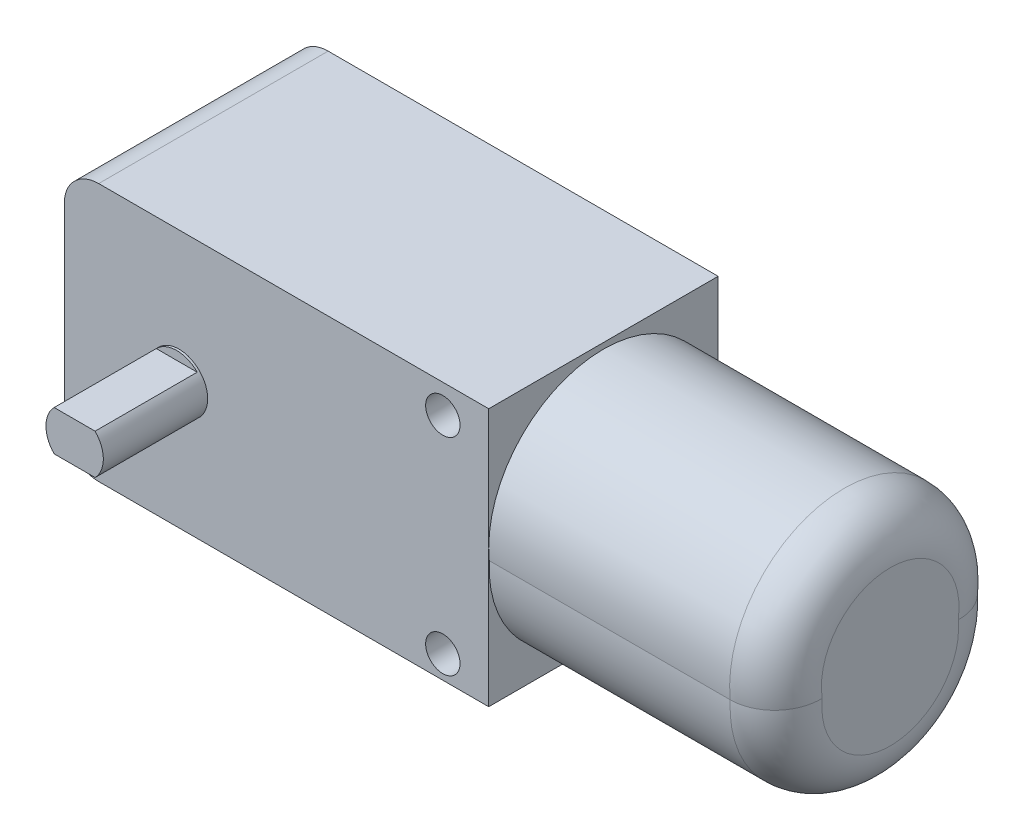
ISO-10303-21;
HEADER;
FILE_DESCRIPTION(('STEP AP214'),'2;1');
FILE_NAME('part.step','',(''),(''),'','','');
FILE_SCHEMA(('AUTOMOTIVE_DESIGN { 1 0 10303 214 1 1 1 1 }'));
ENDSEC;
DATA;
#1=APPLICATION_CONTEXT('core data for automotive mechanical design processes');
#2=APPLICATION_PROTOCOL_DEFINITION('international standard','automotive_design',2000,#1);
#3=PRODUCT_CONTEXT('',#1,'mechanical');
#4=PRODUCT('Part','Part','',(#3));
#5=PRODUCT_RELATED_PRODUCT_CATEGORY('part','',(#4));
#6=PRODUCT_DEFINITION_FORMATION('','',#4);
#7=PRODUCT_DEFINITION_CONTEXT('part definition',#1,'design');
#8=PRODUCT_DEFINITION('design','',#6,#7);
#9=PRODUCT_DEFINITION_SHAPE('','',#8);
#10=(LENGTH_UNIT() NAMED_UNIT(*) SI_UNIT(.MILLI.,.METRE.));
#11=(NAMED_UNIT(*) PLANE_ANGLE_UNIT() SI_UNIT($,.RADIAN.));
#12=(NAMED_UNIT(*) SI_UNIT($,.STERADIAN.) SOLID_ANGLE_UNIT());
#13=UNCERTAINTY_MEASURE_WITH_UNIT(LENGTH_MEASURE(1.E-05),#10,'distance_accuracy_value','');
#14=(GEOMETRIC_REPRESENTATION_CONTEXT(3) GLOBAL_UNCERTAINTY_ASSIGNED_CONTEXT((#13)) GLOBAL_UNIT_ASSIGNED_CONTEXT((#10,
#11,#12)) REPRESENTATION_CONTEXT('',''));
#15=CARTESIAN_POINT('',(0.,0.,0.));
#16=DIRECTION('',(0.,0.,1.));
#17=DIRECTION('',(1.,0.,0.));
#18=AXIS2_PLACEMENT_3D('',#15,#16,#17);
#19=CARTESIAN_POINT('',(-64.2641007815364,-2.5,-20.));
#20=DIRECTION('',(-1.,0.,0.));
#21=DIRECTION('',(0.,0.,1.));
#22=AXIS2_PLACEMENT_3D('',#19,#20,#21);
#23=PLANE('',#22);
#24=DIRECTION('',(0.,-1.,0.));
#25=VECTOR('',#24,1.);
#26=CARTESIAN_POINT('',(-64.2641007815364,-2.5,0.));
#27=LINE('',#26,#25);
#28=CARTESIAN_POINT('',(-64.2641007815364,-5.5,0.));
#29=VERTEX_POINT('',#28);
#30=CARTESIAN_POINT('',(-64.2641007815364,-22.,0.));
#31=VERTEX_POINT('',#30);
#32=EDGE_CURVE('E236',#29,#31,#27,.T.);
#33=ORIENTED_EDGE('',*,*,#32,.F.);
#34=DIRECTION('',(0.,0.,1.));
#35=VECTOR('',#34,1.);
#36=CARTESIAN_POINT('',(-64.2641007815364,-5.5,-20.));
#37=LINE('',#36,#35);
#38=CARTESIAN_POINT('',(-64.2641007815364,-5.5,-20.));
#39=VERTEX_POINT('',#38);
#40=EDGE_CURVE('E294',#29,#39,#37,.F.);
#41=ORIENTED_EDGE('',*,*,#40,.T.);
#42=DIRECTION('',(0.,-1.,0.));
#43=VECTOR('',#42,1.);
#44=CARTESIAN_POINT('',(-64.2641007815364,-2.5,-20.));
#45=LINE('',#44,#43);
#46=CARTESIAN_POINT('',(-64.2641007815364,-22.,-20.));
#47=VERTEX_POINT('',#46);
#48=EDGE_CURVE('E237',#39,#47,#45,.T.);
#49=ORIENTED_EDGE('',*,*,#48,.T.);
#50=DIRECTION('',(0.,0.,1.));
#51=VECTOR('',#50,1.);
#52=CARTESIAN_POINT('',(-64.2641007815364,-22.,-20.));
#53=LINE('',#52,#51);
#54=EDGE_CURVE('E290',#47,#31,#53,.T.);
#55=ORIENTED_EDGE('',*,*,#54,.T.);
#56=EDGE_LOOP('',(#33,#41,#49,#55));
#57=FACE_BOUND('',#56,.T.);
#58=DIRECTION('',(0.,0.,-1.));
#59=VECTOR('',#58,1.);
#60=CARTESIAN_POINT('',(-64.2641007815364,-11.25,-8.625));
#61=LINE('',#60,#59);
#62=CARTESIAN_POINT('',(-64.2641007815364,-11.25,-8.625));
#63=VERTEX_POINT('',#62);
#64=CARTESIAN_POINT('',(-64.2641007815364,-11.25,-11.375));
#65=VERTEX_POINT('',#64);
#66=EDGE_CURVE('E523',#63,#65,#61,.T.);
#67=ORIENTED_EDGE('',*,*,#66,.F.);
#68=DIRECTION('',(0.,1.,0.));
#69=VECTOR('',#68,1.);
#70=CARTESIAN_POINT('',(-64.2641007815364,-16.25,-8.625));
#71=LINE('',#70,#69);
#72=CARTESIAN_POINT('',(-64.2641007815364,-16.25,-8.625));
#73=VERTEX_POINT('',#72);
#74=EDGE_CURVE('E504',#73,#63,#71,.T.);
#75=ORIENTED_EDGE('',*,*,#74,.F.);
#76=DIRECTION('',(0.,0.,1.));
#77=VECTOR('',#76,1.);
#78=CARTESIAN_POINT('',(-64.2641007815364,-16.25,-8.625));
#79=LINE('',#78,#77);
#80=CARTESIAN_POINT('',(-64.2641007815364,-16.25,-11.375));
#81=VERTEX_POINT('',#80);
#82=EDGE_CURVE('E510',#81,#73,#79,.T.);
#83=ORIENTED_EDGE('',*,*,#82,.F.);
#84=DIRECTION('',(0.,-1.,0.));
#85=VECTOR('',#84,1.);
#86=CARTESIAN_POINT('',(-64.2641007815364,-16.25,-11.375));
#87=LINE('',#86,#85);
#88=EDGE_CURVE('E526',#65,#81,#87,.T.);
#89=ORIENTED_EDGE('',*,*,#88,.F.);
#90=EDGE_LOOP('',(#67,#75,#83,#89));
#91=FACE_BOUND('',#90,.T.);
#92=ADVANCED_FACE('F41',(#57,#91),#23,.T.);
#93=CARTESIAN_POINT('',(-27.2641007815364,-2.5,-20.));
#94=DIRECTION('',(1.,0.,0.));
#95=DIRECTION('',(0.,1.,0.));
#96=AXIS2_PLACEMENT_3D('',#93,#94,#95);
#97=PLANE('',#96);
#98=CARTESIAN_POINT('',(-27.2641007815364,-13.,-10.));
#99=DIRECTION('',(1.,0.,0.));
#100=DIRECTION('',(0.,1.,0.));
#101=AXIS2_PLACEMENT_3D('',#98,#99,#100);
#102=CIRCLE('',#101,10.);
#103=CARTESIAN_POINT('',(-27.2641007815364,-14.,-19.9498743710662));
#104=VERTEX_POINT('',#103);
#105=CARTESIAN_POINT('',(-27.2641007815364,-13.,-20.));
#106=VERTEX_POINT('',#105);
#107=EDGE_CURVE('E210',#104,#106,#102,.T.);
#108=ORIENTED_EDGE('',*,*,#107,.F.);
#109=CARTESIAN_POINT('',(-27.2641007815364,-14.5,-10.));
#110=DIRECTION('',(1.,0.,0.));
#111=DIRECTION('',(0.,1.,0.));
#112=AXIS2_PLACEMENT_3D('',#109,#110,#111);
#113=CIRCLE('',#112,9.96242942258564);
#114=CARTESIAN_POINT('',(-27.2641007815364,-14.,-0.050125628933799));
#115=VERTEX_POINT('',#114);
#116=EDGE_CURVE('E214',#115,#104,#113,.T.);
#117=ORIENTED_EDGE('',*,*,#116,.F.);
#118=CARTESIAN_POINT('',(-27.2641007815364,-13.,0.));
#119=VERTEX_POINT('',#118);
#120=EDGE_CURVE('E217',#119,#115,#102,.T.);
#121=ORIENTED_EDGE('',*,*,#120,.F.);
#122=DIRECTION('',(0.,1.,0.));
#123=VECTOR('',#122,1.);
#124=CARTESIAN_POINT('',(-27.2641007815364,-2.5,0.));
#125=LINE('',#124,#123);
#126=CARTESIAN_POINT('',(-27.2641007815364,-25.,0.));
#127=VERTEX_POINT('',#126);
#128=EDGE_CURVE('E262',#127,#119,#125,.T.);
#129=ORIENTED_EDGE('',*,*,#128,.F.);
#130=DIRECTION('',(0.,0.,1.));
#131=VECTOR('',#130,1.);
#132=CARTESIAN_POINT('',(-27.2641007815364,-25.,-20.));
#133=LINE('',#132,#131);
#134=CARTESIAN_POINT('',(-27.2641007815364,-25.,-20.));
#135=VERTEX_POINT('',#134);
#136=EDGE_CURVE('E254',#135,#127,#133,.T.);
#137=ORIENTED_EDGE('',*,*,#136,.F.);
#138=DIRECTION('',(0.,1.,0.));
#139=VECTOR('',#138,1.);
#140=CARTESIAN_POINT('',(-27.2641007815364,-2.5,-20.));
#141=LINE('',#140,#139);
#142=EDGE_CURVE('E246',#135,#106,#141,.T.);
#143=ORIENTED_EDGE('',*,*,#142,.T.);
#144=EDGE_LOOP('',(#108,#117,#121,#129,#137,#143));
#145=FACE_BOUND('',#144,.T.);
#146=ADVANCED_FACE('F351',(#145),#97,.T.);
#147=CARTESIAN_POINT('',(-64.2641007815364,-2.5,-20.));
#148=DIRECTION('',(0.,1.,0.));
#149=DIRECTION('',(0.,0.,1.));
#150=AXIS2_PLACEMENT_3D('',#147,#148,#149);
#151=PLANE('',#150);
#152=DIRECTION('',(-1.,0.,0.));
#153=VECTOR('',#152,1.);
#154=CARTESIAN_POINT('',(-64.2641007815364,-2.5,-20.));
#155=LINE('',#154,#153);
#156=CARTESIAN_POINT('',(-27.2641007815364,-2.5,-20.));
#157=VERTEX_POINT('',#156);
#158=CARTESIAN_POINT('',(-61.2641007815363,-2.5,-20.));
#159=VERTEX_POINT('',#158);
#160=EDGE_CURVE('E250',#157,#159,#155,.T.);
#161=ORIENTED_EDGE('',*,*,#160,.T.);
#162=DIRECTION('',(0.,0.,1.));
#163=VECTOR('',#162,1.);
#164=CARTESIAN_POINT('',(-61.2641007815363,-2.5,-20.));
#165=LINE('',#164,#163);
#166=CARTESIAN_POINT('',(-61.2641007815363,-2.5,0.));
#167=VERTEX_POINT('',#166);
#168=EDGE_CURVE('E280',#159,#167,#165,.T.);
#169=ORIENTED_EDGE('',*,*,#168,.T.);
#170=DIRECTION('',(-1.,0.,0.));
#171=VECTOR('',#170,1.);
#172=CARTESIAN_POINT('',(-64.2641007815364,-2.5,0.));
#173=LINE('',#172,#171);
#174=CARTESIAN_POINT('',(-27.2641007815364,-2.5,0.));
#175=VERTEX_POINT('',#174);
#176=EDGE_CURVE('E242',#175,#167,#173,.T.);
#177=ORIENTED_EDGE('',*,*,#176,.F.);
#178=DIRECTION('',(0.,0.,1.));
#179=VECTOR('',#178,1.);
#180=CARTESIAN_POINT('',(-27.2641007815364,-2.5,-20.));
#181=LINE('',#180,#179);
#182=EDGE_CURVE('E269',#157,#175,#181,.T.);
#183=ORIENTED_EDGE('',*,*,#182,.F.);
#184=EDGE_LOOP('',(#161,#169,#177,#183));
#185=FACE_BOUND('',#184,.T.);
#186=ADVANCED_FACE('F361',(#185),#151,.T.);
#187=EDGE_CURVE('E216',#106,#119,#102,.T.);
#188=ORIENTED_EDGE('',*,*,#187,.F.);
#189=EDGE_CURVE('E245',#106,#157,#141,.T.);
#190=ORIENTED_EDGE('',*,*,#189,.T.);
#191=ORIENTED_EDGE('',*,*,#182,.T.);
#192=EDGE_CURVE('E261',#119,#175,#125,.T.);
#193=ORIENTED_EDGE('',*,*,#192,.F.);
#194=EDGE_LOOP('',(#188,#190,#191,#193));
#195=FACE_BOUND('',#194,.T.);
#196=ADVANCED_FACE('F357',(#195),#97,.T.);
#197=CARTESIAN_POINT('',(-64.2641007815364,-25.,-20.));
#198=DIRECTION('',(0.,-1.,0.));
#199=DIRECTION('',(0.,0.,-1.));
#200=AXIS2_PLACEMENT_3D('',#197,#198,#199);
#201=PLANE('',#200);
#202=DIRECTION('',(1.,0.,0.));
#203=VECTOR('',#202,1.);
#204=CARTESIAN_POINT('',(-64.2641007815364,-25.,0.));
#205=LINE('',#204,#203);
#206=CARTESIAN_POINT('',(-61.2641007815363,-25.,0.));
#207=VERTEX_POINT('',#206);
#208=EDGE_CURVE('E258',#207,#127,#205,.T.);
#209=ORIENTED_EDGE('',*,*,#208,.F.);
#210=DIRECTION('',(0.,0.,1.));
#211=VECTOR('',#210,1.);
#212=CARTESIAN_POINT('',(-61.2641007815363,-25.,-20.));
#213=LINE('',#212,#211);
#214=CARTESIAN_POINT('',(-61.2641007815363,-25.,-20.));
#215=VERTEX_POINT('',#214);
#216=EDGE_CURVE('E302',#207,#215,#213,.F.);
#217=ORIENTED_EDGE('',*,*,#216,.T.);
#218=DIRECTION('',(1.,0.,0.));
#219=VECTOR('',#218,1.);
#220=CARTESIAN_POINT('',(-64.2641007815364,-25.,-20.));
#221=LINE('',#220,#219);
#222=EDGE_CURVE('E241',#215,#135,#221,.T.);
#223=ORIENTED_EDGE('',*,*,#222,.T.);
#224=ORIENTED_EDGE('',*,*,#136,.T.);
#225=EDGE_LOOP('',(#209,#217,#223,#224));
#226=FACE_BOUND('',#225,.T.);
#227=ADVANCED_FACE('F353',(#226),#201,.T.);
#228=CARTESIAN_POINT('',(0.,0.,-20.));
#229=DIRECTION('',(0.,0.,1.));
#230=DIRECTION('',(1.,0.,0.));
#231=AXIS2_PLACEMENT_3D('',#228,#229,#230);
#232=PLANE('',#231);
#233=CARTESIAN_POINT('',(-31.2641007815364,-23.,-20.));
#234=DIRECTION('',(0.,0.,-1.));
#235=DIRECTION('',(-1.,0.,0.));
#236=AXIS2_PLACEMENT_3D('',#233,#234,#235);
#237=CIRCLE('',#236,1.5);
#238=CARTESIAN_POINT('',(-32.7641007815364,-23.,-20.));
#239=VERTEX_POINT('',#238);
#240=EDGE_CURVE('E486',#239,#239,#237,.T.);
#241=ORIENTED_EDGE('',*,*,#240,.F.);
#242=EDGE_LOOP('',(#241));
#243=FACE_BOUND('',#242,.T.);
#244=CARTESIAN_POINT('',(-31.2641007815364,-4.99999999999999,-20.));
#245=DIRECTION('',(0.,0.,-1.));
#246=DIRECTION('',(-1.,0.,0.));
#247=AXIS2_PLACEMENT_3D('',#244,#245,#246);
#248=CIRCLE('',#247,1.5);
#249=CARTESIAN_POINT('',(-32.7641007815364,-4.99999999999999,-20.));
#250=VERTEX_POINT('',#249);
#251=EDGE_CURVE('E491',#250,#250,#248,.T.);
#252=ORIENTED_EDGE('',*,*,#251,.F.);
#253=EDGE_LOOP('',(#252));
#254=FACE_BOUND('',#253,.T.);
#255=CARTESIAN_POINT('',(-54.2641007815363,-14.,-20.));
#256=DIRECTION('',(0.,0.,1.));
#257=DIRECTION('',(1.,0.,0.));
#258=AXIS2_PLACEMENT_3D('',#255,#256,#257);
#259=CIRCLE('',#258,2.5);
#260=CARTESIAN_POINT('',(-51.7641007815363,-14.,-20.));
#261=VERTEX_POINT('',#260);
#262=EDGE_CURVE('E276',#261,#261,#259,.F.);
#263=ORIENTED_EDGE('',*,*,#262,.F.);
#264=EDGE_LOOP('',(#263));
#265=FACE_BOUND('',#264,.T.);
#266=ORIENTED_EDGE('',*,*,#48,.F.);
#267=CARTESIAN_POINT('',(-61.2641007815363,-5.5,-20.));
#268=DIRECTION('',(0.,0.,1.));
#269=DIRECTION('',(1.,0.,0.));
#270=AXIS2_PLACEMENT_3D('',#267,#268,#269);
#271=CIRCLE('',#270,3.);
#272=EDGE_CURVE('E299',#39,#159,#271,.F.);
#273=ORIENTED_EDGE('',*,*,#272,.T.);
#274=ORIENTED_EDGE('',*,*,#160,.F.);
#275=ORIENTED_EDGE('',*,*,#189,.F.);
#276=ORIENTED_EDGE('',*,*,#142,.F.);
#277=ORIENTED_EDGE('',*,*,#222,.F.);
#278=CARTESIAN_POINT('',(-61.2641007815363,-22.,-20.));
#279=DIRECTION('',(0.,0.,1.));
#280=DIRECTION('',(1.,0.,0.));
#281=AXIS2_PLACEMENT_3D('',#278,#279,#280);
#282=CIRCLE('',#281,3.);
#283=EDGE_CURVE('E297',#215,#47,#282,.F.);
#284=ORIENTED_EDGE('',*,*,#283,.T.);
#285=EDGE_LOOP('',(#266,#273,#274,#275,#276,#277,#284));
#286=FACE_BOUND('',#285,.T.);
#287=ADVANCED_FACE('F356',(#243,#254,#265,#286),#232,.F.);
#288=CARTESIAN_POINT('',(0.,0.,0.));
#289=DIRECTION('',(0.,0.,1.));
#290=DIRECTION('',(1.,0.,0.));
#291=AXIS2_PLACEMENT_3D('',#288,#289,#290);
#292=PLANE('',#291);
#293=CARTESIAN_POINT('',(-31.2641007815364,-23.,0.));
#294=DIRECTION('',(0.,0.,1.));
#295=DIRECTION('',(1.,0.,0.));
#296=AXIS2_PLACEMENT_3D('',#293,#294,#295);
#297=CIRCLE('',#296,1.5);
#298=CARTESIAN_POINT('',(-29.7641007815363,-23.,0.));
#299=VERTEX_POINT('',#298);
#300=EDGE_CURVE('E490',#299,#299,#297,.T.);
#301=ORIENTED_EDGE('',*,*,#300,.F.);
#302=EDGE_LOOP('',(#301));
#303=FACE_BOUND('',#302,.T.);
#304=CARTESIAN_POINT('',(-31.2641007815364,-4.99999999999999,0.));
#305=DIRECTION('',(0.,0.,1.));
#306=DIRECTION('',(1.,0.,0.));
#307=AXIS2_PLACEMENT_3D('',#304,#305,#306);
#308=CIRCLE('',#307,1.5);
#309=CARTESIAN_POINT('',(-29.7641007815364,-4.99999999999999,0.));
#310=VERTEX_POINT('',#309);
#311=EDGE_CURVE('E495',#310,#310,#308,.T.);
#312=ORIENTED_EDGE('',*,*,#311,.F.);
#313=EDGE_LOOP('',(#312));
#314=FACE_BOUND('',#313,.T.);
#315=CARTESIAN_POINT('',(-54.2641007815363,-14.,0.));
#316=DIRECTION('',(0.,0.,1.));
#317=DIRECTION('',(1.,0.,0.));
#318=AXIS2_PLACEMENT_3D('',#315,#316,#317);
#319=CIRCLE('',#318,2.5);
#320=CARTESIAN_POINT('',(-51.7641007815363,-14.,0.));
#321=VERTEX_POINT('',#320);
#322=EDGE_CURVE('E218',#321,#321,#319,.T.);
#323=ORIENTED_EDGE('',*,*,#322,.F.);
#324=EDGE_LOOP('',(#323));
#325=FACE_BOUND('',#324,.T.);
#326=ORIENTED_EDGE('',*,*,#176,.T.);
#327=CARTESIAN_POINT('',(-61.2641007815363,-5.5,0.));
#328=DIRECTION('',(0.,0.,1.));
#329=DIRECTION('',(1.,0.,0.));
#330=AXIS2_PLACEMENT_3D('',#327,#328,#329);
#331=CIRCLE('',#330,3.);
#332=EDGE_CURVE('E287',#167,#29,#331,.T.);
#333=ORIENTED_EDGE('',*,*,#332,.T.);
#334=ORIENTED_EDGE('',*,*,#32,.T.);
#335=CARTESIAN_POINT('',(-61.2641007815363,-22.,0.));
#336=DIRECTION('',(0.,0.,1.));
#337=DIRECTION('',(1.,0.,0.));
#338=AXIS2_PLACEMENT_3D('',#335,#336,#337);
#339=CIRCLE('',#338,3.);
#340=EDGE_CURVE('E284',#31,#207,#339,.T.);
#341=ORIENTED_EDGE('',*,*,#340,.T.);
#342=ORIENTED_EDGE('',*,*,#208,.T.);
#343=ORIENTED_EDGE('',*,*,#128,.T.);
#344=ORIENTED_EDGE('',*,*,#192,.T.);
#345=EDGE_LOOP('',(#326,#333,#334,#341,#342,#343,#344));
#346=FACE_BOUND('',#345,.T.);
#347=ADVANCED_FACE('F366',(#303,#314,#325,#346),#292,.T.);
#348=CARTESIAN_POINT('',(-2.26410078153636,-13.,-10.));
#349=DIRECTION('',(-1.,0.,0.));
#350=DIRECTION('',(0.,-1.,0.));
#351=AXIS2_PLACEMENT_3D('',#348,#349,#350);
#352=CYLINDRICAL_SURFACE('',#351,10.);
#353=DIRECTION('',(-1.,0.,0.));
#354=VECTOR('',#353,1.);
#355=CARTESIAN_POINT('',(-2.26410078153636,-14.,-0.050125628933799));
#356=LINE('',#355,#354);
#357=CARTESIAN_POINT('',(-6.26410078153636,-14.,-0.050125628933799));
#358=VERTEX_POINT('',#357);
#359=EDGE_CURVE('E233',#358,#115,#356,.T.);
#360=ORIENTED_EDGE('',*,*,#359,.F.);
#361=CARTESIAN_POINT('',(-6.26410078153636,-13.,-10.));
#362=DIRECTION('',(1.,0.,0.));
#363=DIRECTION('',(0.,1.,0.));
#364=AXIS2_PLACEMENT_3D('',#361,#362,#363);
#365=CIRCLE('',#364,10.);
#366=CARTESIAN_POINT('',(-6.26410078153636,-14.,-19.9498743710662));
#367=VERTEX_POINT('',#366);
#368=EDGE_CURVE('E312',#358,#367,#365,.F.);
#369=ORIENTED_EDGE('',*,*,#368,.T.);
#370=DIRECTION('',(-1.,0.,0.));
#371=VECTOR('',#370,1.);
#372=CARTESIAN_POINT('',(-2.26410078153636,-14.,-19.9498743710662));
#373=LINE('',#372,#371);
#374=EDGE_CURVE('E230',#367,#104,#373,.T.);
#375=ORIENTED_EDGE('',*,*,#374,.T.);
#376=ORIENTED_EDGE('',*,*,#107,.T.);
#377=ORIENTED_EDGE('',*,*,#187,.T.);
#378=ORIENTED_EDGE('',*,*,#120,.T.);
#379=EDGE_LOOP('',(#360,#369,#375,#376,#377,#378));
#380=FACE_BOUND('',#379,.T.);
#381=ADVANCED_FACE('F369',(#380),#352,.T.);
#382=CARTESIAN_POINT('',(-2.26410078153636,-14.5,-10.));
#383=DIRECTION('',(-1.,0.,0.));
#384=DIRECTION('',(0.,-1.,0.));
#385=AXIS2_PLACEMENT_3D('',#382,#383,#384);
#386=CYLINDRICAL_SURFACE('',#385,9.96242942258564);
#387=ORIENTED_EDGE('',*,*,#374,.F.);
#388=CARTESIAN_POINT('',(-6.26410078153636,-14.5,-10.));
#389=DIRECTION('',(1.,0.,0.));
#390=DIRECTION('',(0.,1.,0.));
#391=AXIS2_PLACEMENT_3D('',#388,#389,#390);
#392=CIRCLE('',#391,9.96242942258564);
#393=EDGE_CURVE('E316',#367,#358,#392,.F.);
#394=ORIENTED_EDGE('',*,*,#393,.T.);
#395=ORIENTED_EDGE('',*,*,#359,.T.);
#396=ORIENTED_EDGE('',*,*,#116,.T.);
#397=EDGE_LOOP('',(#387,#394,#395,#396));
#398=FACE_BOUND('',#397,.T.);
#399=ADVANCED_FACE('F376',(#398),#386,.T.);
#400=CARTESIAN_POINT('',(-2.26410078153636,-13.75,-10.));
#401=DIRECTION('',(1.,0.,0.));
#402=DIRECTION('',(0.,1.,0.));
#403=AXIS2_PLACEMENT_3D('',#400,#401,#402);
#404=PLANE('',#403);
#405=CARTESIAN_POINT('',(-2.26410078153636,-14.5,-10.));
#406=DIRECTION('',(1.,0.,0.));
#407=DIRECTION('',(0.,1.,0.));
#408=AXIS2_PLACEMENT_3D('',#405,#406,#407);
#409=CIRCLE('',#408,5.96242942258564);
#410=CARTESIAN_POINT('',(-2.26410078153636,-13.8998117935617,-4.06785546904264));
#411=VERTEX_POINT('',#410);
#412=CARTESIAN_POINT('',(-2.26410078153636,-13.8998117935617,-15.9321445309574));
#413=VERTEX_POINT('',#412);
#414=EDGE_CURVE('E305',#411,#413,#409,.T.);
#415=ORIENTED_EDGE('',*,*,#414,.T.);
#416=CARTESIAN_POINT('',(-2.26410078153636,-13.,-10.));
#417=DIRECTION('',(1.,0.,0.));
#418=DIRECTION('',(0.,1.,0.));
#419=AXIS2_PLACEMENT_3D('',#416,#417,#418);
#420=CIRCLE('',#419,6.00000000000001);
#421=EDGE_CURVE('E308',#413,#411,#420,.T.);
#422=ORIENTED_EDGE('',*,*,#421,.T.);
#423=EDGE_LOOP('',(#415,#422));
#424=FACE_BOUND('',#423,.T.);
#425=ADVANCED_FACE('F380',(#424),#404,.T.);
#426=CARTESIAN_POINT('',(-54.2641007815363,-14.,9.1));
#427=DIRECTION('',(0.,0.,-1.));
#428=DIRECTION('',(-1.,0.,0.));
#429=AXIS2_PLACEMENT_3D('',#426,#427,#428);
#430=CYLINDRICAL_SURFACE('',#429,2.5);
#431=CARTESIAN_POINT('',(-54.2641007815363,-14.,9.1));
#432=DIRECTION('',(0.,0.,1.));
#433=DIRECTION('',(1.,0.,0.));
#434=AXIS2_PLACEMENT_3D('',#431,#432,#433);
#435=CIRCLE('',#434,2.5);
#436=CARTESIAN_POINT('',(-56.0494578886721,-12.25,9.1));
#437=VERTEX_POINT('',#436);
#438=CARTESIAN_POINT('',(-56.0494578886721,-15.75,9.1));
#439=VERTEX_POINT('',#438);
#440=EDGE_CURVE('E206',#437,#439,#435,.T.);
#441=ORIENTED_EDGE('',*,*,#440,.F.);
#442=DIRECTION('',(0.,0.,-1.));
#443=VECTOR('',#442,1.);
#444=CARTESIAN_POINT('',(-56.0494578886721,-12.25,9.1));
#445=LINE('',#444,#443);
#446=CARTESIAN_POINT('',(-56.0494578886721,-12.25,0.200000000000001));
#447=VERTEX_POINT('',#446);
#448=EDGE_CURVE('E65',#437,#447,#445,.T.);
#449=ORIENTED_EDGE('',*,*,#448,.T.);
#450=CARTESIAN_POINT('',(-54.2641007815363,-14.,0.200000000000001));
#451=DIRECTION('',(0.,0.,1.));
#452=DIRECTION('',(1.,0.,0.));
#453=AXIS2_PLACEMENT_3D('',#450,#451,#452);
#454=CIRCLE('',#453,2.5);
#455=CARTESIAN_POINT('',(-52.4787436744006,-12.25,0.200000000000001));
#456=VERTEX_POINT('',#455);
#457=EDGE_CURVE('E11',#456,#447,#454,.T.);
#458=ORIENTED_EDGE('',*,*,#457,.F.);
#459=DIRECTION('',(0.,0.,-1.));
#460=VECTOR('',#459,1.);
#461=CARTESIAN_POINT('',(-52.4787436744006,-12.25,9.1));
#462=LINE('',#461,#460);
#463=CARTESIAN_POINT('',(-52.4787436744006,-12.25,9.1));
#464=VERTEX_POINT('',#463);
#465=EDGE_CURVE('E461',#456,#464,#462,.F.);
#466=ORIENTED_EDGE('',*,*,#465,.T.);
#467=CARTESIAN_POINT('',(-52.4787436744006,-15.75,9.1));
#468=VERTEX_POINT('',#467);
#469=EDGE_CURVE('E211',#468,#464,#435,.T.);
#470=ORIENTED_EDGE('',*,*,#469,.F.);
#471=DIRECTION('',(0.,0.,-1.));
#472=VECTOR('',#471,1.);
#473=CARTESIAN_POINT('',(-52.4787436744006,-15.75,9.1));
#474=LINE('',#473,#472);
#475=CARTESIAN_POINT('',(-52.4787436744006,-15.75,0.200000000000001));
#476=VERTEX_POINT('',#475);
#477=EDGE_CURVE('E57',#468,#476,#474,.T.);
#478=ORIENTED_EDGE('',*,*,#477,.T.);
#479=CARTESIAN_POINT('',(-54.2641007815363,-14.,0.200000000000001));
#480=DIRECTION('',(0.,0.,1.));
#481=DIRECTION('',(1.,0.,0.));
#482=AXIS2_PLACEMENT_3D('',#479,#480,#481);
#483=CIRCLE('',#482,2.5);
#484=CARTESIAN_POINT('',(-56.0494578886721,-15.75,0.200000000000001));
#485=VERTEX_POINT('',#484);
#486=EDGE_CURVE('E50',#485,#476,#483,.T.);
#487=ORIENTED_EDGE('',*,*,#486,.F.);
#488=DIRECTION('',(0.,0.,-1.));
#489=VECTOR('',#488,1.);
#490=CARTESIAN_POINT('',(-56.0494578886721,-15.75,9.1));
#491=LINE('',#490,#489);
#492=EDGE_CURVE('E192',#485,#439,#491,.F.);
#493=ORIENTED_EDGE('',*,*,#492,.T.);
#494=EDGE_LOOP('',(#441,#449,#458,#466,#470,#478,#487,#493));
#495=FACE_BOUND('',#494,.T.);
#496=ORIENTED_EDGE('',*,*,#322,.T.);
#497=EDGE_LOOP('',(#496));
#498=FACE_BOUND('',#497,.T.);
#499=ADVANCED_FACE('F204',(#495,#498),#430,.T.);
#500=CARTESIAN_POINT('',(-54.2641007815363,-14.,9.1));
#501=DIRECTION('',(0.,0.,1.));
#502=DIRECTION('',(1.,0.,0.));
#503=AXIS2_PLACEMENT_3D('',#500,#501,#502);
#504=PLANE('',#503);
#505=DIRECTION('',(1.,0.,0.));
#506=VECTOR('',#505,1.);
#507=CARTESIAN_POINT('',(-54.2641007815363,-12.25,9.1));
#508=LINE('',#507,#506);
#509=EDGE_CURVE('E198',#437,#464,#508,.T.);
#510=ORIENTED_EDGE('',*,*,#509,.F.);
#511=ORIENTED_EDGE('',*,*,#440,.T.);
#512=DIRECTION('',(-1.,0.,0.));
#513=VECTOR('',#512,1.);
#514=CARTESIAN_POINT('',(-54.2641007815363,-15.75,9.1));
#515=LINE('',#514,#513);
#516=EDGE_CURVE('E189',#468,#439,#515,.T.);
#517=ORIENTED_EDGE('',*,*,#516,.F.);
#518=ORIENTED_EDGE('',*,*,#469,.T.);
#519=EDGE_LOOP('',(#510,#511,#517,#518));
#520=FACE_BOUND('',#519,.T.);
#521=ADVANCED_FACE('F209',(#520),#504,.T.);
#522=CARTESIAN_POINT('',(-54.2641007815363,-14.,-29.1));
#523=DIRECTION('',(0.,0.,1.));
#524=DIRECTION('',(1.,0.,0.));
#525=AXIS2_PLACEMENT_3D('',#522,#523,#524);
#526=CYLINDRICAL_SURFACE('',#525,2.5);
#527=CARTESIAN_POINT('',(-54.2641007815363,-14.,-29.1));
#528=DIRECTION('',(0.,0.,-1.));
#529=DIRECTION('',(-1.,0.,0.));
#530=AXIS2_PLACEMENT_3D('',#527,#528,#529);
#531=CIRCLE('',#530,2.5);
#532=CARTESIAN_POINT('',(-56.0494578886721,-15.75,-29.1));
#533=VERTEX_POINT('',#532);
#534=CARTESIAN_POINT('',(-56.0494578886721,-12.25,-29.1));
#535=VERTEX_POINT('',#534);
#536=EDGE_CURVE('E221',#533,#535,#531,.T.);
#537=ORIENTED_EDGE('',*,*,#536,.F.);
#538=DIRECTION('',(0.,0.,1.));
#539=VECTOR('',#538,1.);
#540=CARTESIAN_POINT('',(-56.0494578886721,-15.75,-29.1));
#541=LINE('',#540,#539);
#542=CARTESIAN_POINT('',(-56.0494578886721,-15.75,-20.2));
#543=VERTEX_POINT('',#542);
#544=EDGE_CURVE('E483',#533,#543,#541,.T.);
#545=ORIENTED_EDGE('',*,*,#544,.T.);
#546=CARTESIAN_POINT('',(-54.2641007815363,-14.,-20.2));
#547=DIRECTION('',(0.,0.,-1.));
#548=DIRECTION('',(-1.,0.,0.));
#549=AXIS2_PLACEMENT_3D('',#546,#547,#548);
#550=CIRCLE('',#549,2.5);
#551=CARTESIAN_POINT('',(-52.4787436744006,-15.75,-20.2));
#552=VERTEX_POINT('',#551);
#553=EDGE_CURVE('E199',#552,#543,#550,.T.);
#554=ORIENTED_EDGE('',*,*,#553,.F.);
#555=DIRECTION('',(0.,0.,1.));
#556=VECTOR('',#555,1.);
#557=CARTESIAN_POINT('',(-52.4787436744006,-15.75,-29.1));
#558=LINE('',#557,#556);
#559=CARTESIAN_POINT('',(-52.4787436744006,-15.75,-29.1));
#560=VERTEX_POINT('',#559);
#561=EDGE_CURVE('E480',#552,#560,#558,.F.);
#562=ORIENTED_EDGE('',*,*,#561,.T.);
#563=CARTESIAN_POINT('',(-52.4787436744006,-12.25,-29.1));
#564=VERTEX_POINT('',#563);
#565=EDGE_CURVE('E225',#564,#560,#531,.T.);
#566=ORIENTED_EDGE('',*,*,#565,.F.);
#567=DIRECTION('',(0.,0.,1.));
#568=VECTOR('',#567,1.);
#569=CARTESIAN_POINT('',(-52.4787436744006,-12.25,-29.1));
#570=LINE('',#569,#568);
#571=CARTESIAN_POINT('',(-52.4787436744006,-12.25,-20.2));
#572=VERTEX_POINT('',#571);
#573=EDGE_CURVE('E477',#564,#572,#570,.T.);
#574=ORIENTED_EDGE('',*,*,#573,.T.);
#575=CARTESIAN_POINT('',(-54.2641007815363,-14.,-20.2));
#576=DIRECTION('',(0.,0.,1.));
#577=DIRECTION('',(1.,0.,0.));
#578=AXIS2_PLACEMENT_3D('',#575,#576,#577);
#579=CIRCLE('',#578,2.5);
#580=CARTESIAN_POINT('',(-56.0494578886721,-12.25,-20.2));
#581=VERTEX_POINT('',#580);
#582=EDGE_CURVE('E905',#572,#581,#579,.T.);
#583=ORIENTED_EDGE('',*,*,#582,.T.);
#584=DIRECTION('',(0.,0.,1.));
#585=VECTOR('',#584,1.);
#586=CARTESIAN_POINT('',(-56.0494578886721,-12.25,-29.1));
#587=LINE('',#586,#585);
#588=EDGE_CURVE('E473',#581,#535,#587,.F.);
#589=ORIENTED_EDGE('',*,*,#588,.T.);
#590=EDGE_LOOP('',(#537,#545,#554,#562,#566,#574,#583,#589));
#591=FACE_BOUND('',#590,.T.);
#592=ORIENTED_EDGE('',*,*,#262,.T.);
#593=EDGE_LOOP('',(#592));
#594=FACE_BOUND('',#593,.T.);
#595=ADVANCED_FACE('F389',(#591,#594),#526,.T.);
#596=CARTESIAN_POINT('',(-54.2641007815363,-14.,-29.1));
#597=DIRECTION('',(0.,0.,-1.));
#598=DIRECTION('',(-1.,0.,0.));
#599=AXIS2_PLACEMENT_3D('',#596,#597,#598);
#600=PLANE('',#599);
#601=DIRECTION('',(1.,0.,0.));
#602=VECTOR('',#601,1.);
#603=CARTESIAN_POINT('',(-54.2641007815363,-15.75,-29.1));
#604=LINE('',#603,#602);
#605=EDGE_CURVE('E900',#533,#560,#604,.T.);
#606=ORIENTED_EDGE('',*,*,#605,.F.);
#607=ORIENTED_EDGE('',*,*,#536,.T.);
#608=DIRECTION('',(-1.,0.,0.));
#609=VECTOR('',#608,1.);
#610=CARTESIAN_POINT('',(-54.2641007815363,-12.25,-29.1));
#611=LINE('',#610,#609);
#612=EDGE_CURVE('E319',#564,#535,#611,.T.);
#613=ORIENTED_EDGE('',*,*,#612,.F.);
#614=ORIENTED_EDGE('',*,*,#565,.T.);
#615=EDGE_LOOP('',(#606,#607,#613,#614));
#616=FACE_BOUND('',#615,.T.);
#617=ADVANCED_FACE('F347',(#616),#600,.T.);
#618=CARTESIAN_POINT('',(-61.2641007815363,-5.5,-20.));
#619=DIRECTION('',(0.,0.,1.));
#620=DIRECTION('',(1.,0.,0.));
#621=AXIS2_PLACEMENT_3D('',#618,#619,#620);
#622=CYLINDRICAL_SURFACE('',#621,3.);
#623=ORIENTED_EDGE('',*,*,#272,.F.);
#624=ORIENTED_EDGE('',*,*,#40,.F.);
#625=ORIENTED_EDGE('',*,*,#332,.F.);
#626=ORIENTED_EDGE('',*,*,#168,.F.);
#627=EDGE_LOOP('',(#623,#624,#625,#626));
#628=FACE_BOUND('',#627,.T.);
#629=ADVANCED_FACE('F343',(#628),#622,.T.);
#630=CARTESIAN_POINT('',(-61.2641007815363,-22.,-20.));
#631=DIRECTION('',(0.,0.,1.));
#632=DIRECTION('',(1.,0.,0.));
#633=AXIS2_PLACEMENT_3D('',#630,#631,#632);
#634=CYLINDRICAL_SURFACE('',#633,3.);
#635=ORIENTED_EDGE('',*,*,#283,.F.);
#636=ORIENTED_EDGE('',*,*,#216,.F.);
#637=ORIENTED_EDGE('',*,*,#340,.F.);
#638=ORIENTED_EDGE('',*,*,#54,.F.);
#639=EDGE_LOOP('',(#635,#636,#637,#638));
#640=FACE_BOUND('',#639,.T.);
#641=ADVANCED_FACE('F338',(#640),#634,.T.);
#642=CARTESIAN_POINT('',(-6.26410078153636,-14.5,-10.));
#643=DIRECTION('',(1.,0.,0.));
#644=DIRECTION('',(0.,1.,0.));
#645=AXIS2_PLACEMENT_3D('',#642,#643,#644);
#646=TOROIDAL_SURFACE('',#645,5.96242942258564,4.);
#647=CARTESIAN_POINT('',(-6.26410078153636,-14.,-0.0501256289337972));
#648=CARTESIAN_POINT('',(-6.15185902546831,-14.000000274041,-0.0501147425256198));
#649=CARTESIAN_POINT('',(-6.03962243514195,-13.9998816706764,-0.0548618209978833));
#650=CARTESIAN_POINT('',(-5.815953370965,-13.9994088280504,-0.0737876869232872));
#651=CARTESIAN_POINT('',(-5.70452085610091,-13.9990546008945,-0.0879659898306335));
#652=CARTESIAN_POINT('',(-5.48332479571403,-13.9981129815083,-0.125655997962684));
#653=CARTESIAN_POINT('',(-5.3735600640966,-13.9975257638918,-0.149160713542755));
#654=CARTESIAN_POINT('',(-5.15642855298614,-13.9961230023291,-0.20531106937798));
#655=CARTESIAN_POINT('',(-5.04906174581178,-13.99530746102,-0.237956604053743));
#656=CARTESIAN_POINT('',(-4.73159871379289,-13.9925251282304,-0.349335479338677));
#657=CARTESIAN_POINT('',(-4.52604457629031,-13.9902222198653,-0.441527420558998));
#658=CARTESIAN_POINT('',(-4.13347860753174,-13.9847903439029,-0.659007607916585));
#659=CARTESIAN_POINT('',(-3.94646280497822,-13.9816615537551,-0.784288744495021));
#660=CARTESIAN_POINT('',(-3.59589185790122,-13.9746639843926,-1.06452948481339));
#661=CARTESIAN_POINT('',(-3.43235672688429,-13.9707945803996,-1.21951414645238));
#662=CARTESIAN_POINT('',(-3.13351486852415,-13.962427785588,-1.55471533493232));
#663=CARTESIAN_POINT('',(-2.99821659172907,-13.9579302074436,-1.7349393883715));
#664=CARTESIAN_POINT('',(-2.75931111989228,-13.9484243188543,-2.11597355100318));
#665=CARTESIAN_POINT('',(-2.65579536140018,-13.9434145890847,-2.31684087743359));
#666=CARTESIAN_POINT('',(-2.48386016474512,-13.9330401401763,-2.73298703883004));
#667=CARTESIAN_POINT('',(-2.41541665101331,-13.9276756674168,-2.94825587271769));
#668=CARTESIAN_POINT('',(-2.33262323572276,-13.9186388626452,-3.31110103393218));
#669=CARTESIAN_POINT('',(-2.3077552029003,-13.9150219314222,-3.45638142459727));
#670=CARTESIAN_POINT('',(-2.27400606240202,-13.9077493433409,-3.748634106835));
#671=CARTESIAN_POINT('',(-2.26509821963306,-13.9040937615814,-3.8956031532046));
#672=CARTESIAN_POINT('',(-2.26412709770861,-13.9002319599955,-4.05095251654191));
#673=CARTESIAN_POINT('',(-2.26410071169739,-13.9000218678504,-4.05940421007925));
#674=CARTESIAN_POINT('',(-2.26410078153636,-13.8998117935617,-4.06785546904264));
#675=B_SPLINE_CURVE_WITH_KNOTS('',3,(#647,#648,#649,#650,#651,#652,#653,#654,#655,#656,#657,
#658,#659,#660,#661,#662,#663,#664,#665,#666,#667,#668,#669,#670,#671,#672,#673,#674),
.UNSPECIFIED.,.F.,.F.,(4,2,2,2,2,2,2,2,2,2,2,2,2,4),(0.,0.336615555791165,0.673213818699897,
1.00956029434609,1.34590288524294,2.01830164594818,2.69055605212652,3.36338008855914,
4.03640519570355,4.71134879771961,5.38582845757267,5.82738358676229,6.26819836802391,
6.29356120706971),.UNSPECIFIED.);
#676=EDGE_CURVE('E320',#358,#411,#675,.T.);
#677=ORIENTED_EDGE('',*,*,#676,.F.);
#678=ORIENTED_EDGE('',*,*,#393,.F.);
#679=CARTESIAN_POINT('',(-6.26410078153636,-14.,-19.9498743710662));
#680=CARTESIAN_POINT('',(-6.15185902546831,-14.000000274041,-19.9498852574744));
#681=CARTESIAN_POINT('',(-6.03962243514195,-13.9998816706764,-19.9451381790021));
#682=CARTESIAN_POINT('',(-5.815953370965,-13.9994088280504,-19.9262123130767));
#683=CARTESIAN_POINT('',(-5.70452085610091,-13.9990546008945,-19.9120340101694));
#684=CARTESIAN_POINT('',(-5.48332479571402,-13.9981129815083,-19.8743440020373));
#685=CARTESIAN_POINT('',(-5.3735600640966,-13.9975257638918,-19.8508392864572));
#686=CARTESIAN_POINT('',(-5.15642855298614,-13.996123002329,-19.794688930622));
#687=CARTESIAN_POINT('',(-5.04906174581178,-13.99530746102,-19.7620433959463));
#688=CARTESIAN_POINT('',(-4.73159871379289,-13.9925251282304,-19.6506645206613));
#689=CARTESIAN_POINT('',(-4.52604457629031,-13.9902222198653,-19.558472579441));
#690=CARTESIAN_POINT('',(-4.13347860753174,-13.9847903439029,-19.3409923920834));
#691=CARTESIAN_POINT('',(-3.94646280497822,-13.981661553755,-19.215711255505));
#692=CARTESIAN_POINT('',(-3.59589185790122,-13.9746639843926,-18.9354705151866));
#693=CARTESIAN_POINT('',(-3.43235672688429,-13.9707945803996,-18.7804858535476));
#694=CARTESIAN_POINT('',(-3.13351486852415,-13.962427785588,-18.4452846650677));
#695=CARTESIAN_POINT('',(-2.99821659172907,-13.9579302074436,-18.2650606116285));
#696=CARTESIAN_POINT('',(-2.75931111989228,-13.9484243188542,-17.8840264489968));
#697=CARTESIAN_POINT('',(-2.65579536140018,-13.9434145890847,-17.6831591225664));
#698=CARTESIAN_POINT('',(-2.48386016474512,-13.9330401401763,-17.26701296117));
#699=CARTESIAN_POINT('',(-2.41541665101331,-13.9276756674168,-17.0517441272823));
#700=CARTESIAN_POINT('',(-2.33262323572276,-13.9186388626452,-16.6888989660678));
#701=CARTESIAN_POINT('',(-2.3077552029003,-13.9150219314221,-16.5436185754027));
#702=CARTESIAN_POINT('',(-2.27400606240202,-13.9077493433409,-16.251365893165));
#703=CARTESIAN_POINT('',(-2.26509821963306,-13.9040937615815,-16.1043968467954));
#704=CARTESIAN_POINT('',(-2.26412709770861,-13.9002319599955,-15.9490474834581));
#705=CARTESIAN_POINT('',(-2.26410071169739,-13.9000218678504,-15.9405957899207));
#706=CARTESIAN_POINT('',(-2.26410078153636,-13.8998117935617,-15.9321445309574));
#707=B_SPLINE_CURVE_WITH_KNOTS('',3,(#679,#680,#681,#682,#683,#684,#685,#686,#687,#688,#689,
#690,#691,#692,#693,#694,#695,#696,#697,#698,#699,#700,#701,#702,#703,#704,#705,#706),
.UNSPECIFIED.,.F.,.F.,(4,2,2,2,2,2,2,2,2,2,2,2,2,4),(0.,0.336615555791165,0.673213818699898,
1.00956029434609,1.34590288524294,2.01830164594818,2.69055605212653,3.36338008855914,
4.03640519570354,4.71134879771961,5.38582845757268,5.82738358676229,6.26819836802391,
6.2935612070697),.UNSPECIFIED.);
#708=EDGE_CURVE('E327',#413,#367,#707,.F.);
#709=ORIENTED_EDGE('',*,*,#708,.F.);
#710=ORIENTED_EDGE('',*,*,#414,.F.);
#711=EDGE_LOOP('',(#677,#678,#709,#710));
#712=FACE_BOUND('',#711,.T.);
#713=ADVANCED_FACE('F334',(#712),#646,.T.);
#714=CARTESIAN_POINT('',(-6.26410078153636,-13.,-10.));
#715=DIRECTION('',(1.,0.,0.));
#716=DIRECTION('',(0.,1.,0.));
#717=AXIS2_PLACEMENT_3D('',#714,#715,#716);
#718=TOROIDAL_SURFACE('',#717,6.00000000000001,4.);
#719=ORIENTED_EDGE('',*,*,#708,.T.);
#720=ORIENTED_EDGE('',*,*,#368,.F.);
#721=ORIENTED_EDGE('',*,*,#676,.T.);
#722=ORIENTED_EDGE('',*,*,#421,.F.);
#723=EDGE_LOOP('',(#719,#720,#721,#722));
#724=FACE_BOUND('',#723,.T.);
#725=ADVANCED_FACE('F43',(#724),#718,.T.);
#726=CARTESIAN_POINT('',(-69.2641007815364,-16.25,-8.625));
#727=DIRECTION('',(0.,0.,-1.));
#728=DIRECTION('',(0.,1.,0.));
#729=AXIS2_PLACEMENT_3D('',#726,#727,#728);
#730=PLANE('',#729);
#731=CARTESIAN_POINT('',(-66.7641007815364,-13.75,-8.625));
#732=DIRECTION('',(0.,0.,-1.));
#733=DIRECTION('',(0.,1.,0.));
#734=AXIS2_PLACEMENT_3D('',#731,#732,#733);
#735=CIRCLE('',#734,1.5);
#736=CARTESIAN_POINT('',(-66.7641007815364,-12.25,-8.625));
#737=VERTEX_POINT('',#736);
#738=EDGE_CURVE('E500',#737,#737,#735,.F.);
#739=ORIENTED_EDGE('',*,*,#738,.F.);
#740=EDGE_LOOP('',(#739));
#741=FACE_BOUND('',#740,.T.);
#742=ORIENTED_EDGE('',*,*,#74,.T.);
#743=DIRECTION('',(1.,0.,0.));
#744=VECTOR('',#743,1.);
#745=CARTESIAN_POINT('',(-69.2641007815364,-11.25,-8.625));
#746=LINE('',#745,#744);
#747=CARTESIAN_POINT('',(-69.2641007815364,-11.25,-8.625));
#748=VERTEX_POINT('',#747);
#749=EDGE_CURVE('E328',#748,#63,#746,.T.);
#750=ORIENTED_EDGE('',*,*,#749,.F.);
#751=DIRECTION('',(0.,1.,0.));
#752=VECTOR('',#751,1.);
#753=CARTESIAN_POINT('',(-69.2641007815364,-16.25,-8.625));
#754=LINE('',#753,#752);
#755=CARTESIAN_POINT('',(-69.2641007815364,-16.25,-8.625));
#756=VERTEX_POINT('',#755);
#757=EDGE_CURVE('E505',#756,#748,#754,.T.);
#758=ORIENTED_EDGE('',*,*,#757,.F.);
#759=DIRECTION('',(1.,0.,0.));
#760=VECTOR('',#759,1.);
#761=CARTESIAN_POINT('',(-69.2641007815364,-16.25,-8.625));
#762=LINE('',#761,#760);
#763=EDGE_CURVE('E519',#756,#73,#762,.T.);
#764=ORIENTED_EDGE('',*,*,#763,.T.);
#765=EDGE_LOOP('',(#742,#750,#758,#764));
#766=FACE_BOUND('',#765,.T.);
#767=ADVANCED_FACE('F396',(#741,#766),#730,.F.);
#768=CARTESIAN_POINT('',(-69.2641007815364,-11.25,-8.625));
#769=DIRECTION('',(0.,-1.,0.));
#770=DIRECTION('',(0.,0.,-1.));
#771=AXIS2_PLACEMENT_3D('',#768,#769,#770);
#772=PLANE('',#771);
#773=ORIENTED_EDGE('',*,*,#66,.T.);
#774=DIRECTION('',(1.,0.,0.));
#775=VECTOR('',#774,1.);
#776=CARTESIAN_POINT('',(-69.2641007815364,-11.25,-11.375));
#777=LINE('',#776,#775);
#778=CARTESIAN_POINT('',(-69.2641007815364,-11.25,-11.375));
#779=VERTEX_POINT('',#778);
#780=EDGE_CURVE('E538',#779,#65,#777,.T.);
#781=ORIENTED_EDGE('',*,*,#780,.F.);
#782=DIRECTION('',(0.,0.,-1.));
#783=VECTOR('',#782,1.);
#784=CARTESIAN_POINT('',(-69.2641007815364,-11.25,-8.625));
#785=LINE('',#784,#783);
#786=EDGE_CURVE('E509',#748,#779,#785,.T.);
#787=ORIENTED_EDGE('',*,*,#786,.F.);
#788=ORIENTED_EDGE('',*,*,#749,.T.);
#789=EDGE_LOOP('',(#773,#781,#787,#788));
#790=FACE_BOUND('',#789,.T.);
#791=ADVANCED_FACE('F399',(#790),#772,.F.);
#792=CARTESIAN_POINT('',(-69.2641007815364,-16.25,-11.375));
#793=DIRECTION('',(0.,0.,1.));
#794=DIRECTION('',(1.,0.,0.));
#795=AXIS2_PLACEMENT_3D('',#792,#793,#794);
#796=PLANE('',#795);
#797=CARTESIAN_POINT('',(-66.7641007815364,-13.75,-11.375));
#798=DIRECTION('',(0.,0.,-1.));
#799=DIRECTION('',(-1.,0.,0.));
#800=AXIS2_PLACEMENT_3D('',#797,#798,#799);
#801=CIRCLE('',#800,1.5);
#802=CARTESIAN_POINT('',(-68.2641007815364,-13.75,-11.375));
#803=VERTEX_POINT('',#802);
#804=EDGE_CURVE('E496',#803,#803,#801,.T.);
#805=ORIENTED_EDGE('',*,*,#804,.F.);
#806=EDGE_LOOP('',(#805));
#807=FACE_BOUND('',#806,.T.);
#808=ORIENTED_EDGE('',*,*,#88,.T.);
#809=DIRECTION('',(1.,0.,0.));
#810=VECTOR('',#809,1.);
#811=CARTESIAN_POINT('',(-69.2641007815364,-16.25,-11.375));
#812=LINE('',#811,#810);
#813=CARTESIAN_POINT('',(-69.2641007815364,-16.25,-11.375));
#814=VERTEX_POINT('',#813);
#815=EDGE_CURVE('E535',#814,#81,#812,.T.);
#816=ORIENTED_EDGE('',*,*,#815,.F.);
#817=DIRECTION('',(0.,-1.,0.));
#818=VECTOR('',#817,1.);
#819=CARTESIAN_POINT('',(-69.2641007815364,-16.25,-11.375));
#820=LINE('',#819,#818);
#821=EDGE_CURVE('E513',#779,#814,#820,.T.);
#822=ORIENTED_EDGE('',*,*,#821,.F.);
#823=ORIENTED_EDGE('',*,*,#780,.T.);
#824=EDGE_LOOP('',(#808,#816,#822,#823));
#825=FACE_BOUND('',#824,.T.);
#826=ADVANCED_FACE('F403',(#807,#825),#796,.F.);
#827=CARTESIAN_POINT('',(-69.2641007815364,-16.25,-8.625));
#828=DIRECTION('',(0.,1.,0.));
#829=DIRECTION('',(0.,0.,1.));
#830=AXIS2_PLACEMENT_3D('',#827,#828,#829);
#831=PLANE('',#830);
#832=ORIENTED_EDGE('',*,*,#82,.T.);
#833=ORIENTED_EDGE('',*,*,#763,.F.);
#834=DIRECTION('',(0.,0.,1.));
#835=VECTOR('',#834,1.);
#836=CARTESIAN_POINT('',(-69.2641007815364,-16.25,-8.625));
#837=LINE('',#836,#835);
#838=EDGE_CURVE('E516',#814,#756,#837,.T.);
#839=ORIENTED_EDGE('',*,*,#838,.F.);
#840=ORIENTED_EDGE('',*,*,#815,.T.);
#841=EDGE_LOOP('',(#832,#833,#839,#840));
#842=FACE_BOUND('',#841,.T.);
#843=ADVANCED_FACE('F407',(#842),#831,.F.);
#844=CARTESIAN_POINT('',(-69.2641007815364,0.,0.));
#845=DIRECTION('',(-1.,0.,0.));
#846=DIRECTION('',(0.,0.,1.));
#847=AXIS2_PLACEMENT_3D('',#844,#845,#846);
#848=PLANE('',#847);
#849=ORIENTED_EDGE('',*,*,#757,.T.);
#850=ORIENTED_EDGE('',*,*,#786,.T.);
#851=ORIENTED_EDGE('',*,*,#821,.T.);
#852=ORIENTED_EDGE('',*,*,#838,.T.);
#853=EDGE_LOOP('',(#849,#850,#851,#852));
#854=FACE_BOUND('',#853,.T.);
#855=ADVANCED_FACE('F411',(#854),#848,.T.);
#856=CARTESIAN_POINT('',(-66.7641007815364,-13.75,-4.38235931288072));
#857=DIRECTION('',(0.,0.,-1.));
#858=DIRECTION('',(-1.,0.,0.));
#859=AXIS2_PLACEMENT_3D('',#856,#857,#858);
#860=CYLINDRICAL_SURFACE('',#859,1.5);
#861=ORIENTED_EDGE('',*,*,#738,.T.);
#862=EDGE_LOOP('',(#861));
#863=FACE_BOUND('',#862,.T.);
#864=ORIENTED_EDGE('',*,*,#804,.T.);
#865=EDGE_LOOP('',(#864));
#866=FACE_BOUND('',#865,.T.);
#867=ADVANCED_FACE('F415',(#863,#866),#860,.F.);
#868=CARTESIAN_POINT('',(-31.2641007815364,-4.99999999999999,9.1));
#869=DIRECTION('',(0.,0.,-1.));
#870=DIRECTION('',(-1.,0.,0.));
#871=AXIS2_PLACEMENT_3D('',#868,#869,#870);
#872=CYLINDRICAL_SURFACE('',#871,1.5);
#873=ORIENTED_EDGE('',*,*,#311,.T.);
#874=EDGE_LOOP('',(#873));
#875=FACE_BOUND('',#874,.T.);
#876=ORIENTED_EDGE('',*,*,#251,.T.);
#877=EDGE_LOOP('',(#876));
#878=FACE_BOUND('',#877,.T.);
#879=ADVANCED_FACE('F419',(#875,#878),#872,.F.);
#880=CARTESIAN_POINT('',(-31.2641007815364,-23.,9.1));
#881=DIRECTION('',(0.,0.,-1.));
#882=DIRECTION('',(-1.,0.,0.));
#883=AXIS2_PLACEMENT_3D('',#880,#881,#882);
#884=CYLINDRICAL_SURFACE('',#883,1.5);
#885=ORIENTED_EDGE('',*,*,#300,.T.);
#886=EDGE_LOOP('',(#885));
#887=FACE_BOUND('',#886,.T.);
#888=ORIENTED_EDGE('',*,*,#240,.T.);
#889=EDGE_LOOP('',(#888));
#890=FACE_BOUND('',#889,.T.);
#891=ADVANCED_FACE('F423',(#887,#890),#884,.F.);
#892=CARTESIAN_POINT('',(0.,0.,-20.2));
#893=DIRECTION('',(0.,0.,1.));
#894=DIRECTION('',(1.,0.,0.));
#895=AXIS2_PLACEMENT_3D('',#892,#893,#894);
#896=PLANE('',#895);
#897=DIRECTION('',(-1.,0.,0.));
#898=VECTOR('',#897,1.);
#899=CARTESIAN_POINT('',(-59.1627019815518,-12.25,-20.2));
#900=LINE('',#899,#898);
#901=EDGE_CURVE('E464',#572,#581,#900,.T.);
#902=ORIENTED_EDGE('',*,*,#901,.T.);
#903=ORIENTED_EDGE('',*,*,#582,.F.);
#904=EDGE_LOOP('',(#902,#903));
#905=FACE_BOUND('',#904,.T.);
#906=ADVANCED_FACE('F427',(#905),#896,.F.);
#907=CARTESIAN_POINT('',(-59.1627019815518,-12.25,-20.2));
#908=DIRECTION('',(0.,-1.,0.));
#909=DIRECTION('',(1.,0.,0.));
#910=AXIS2_PLACEMENT_3D('',#907,#908,#909);
#911=PLANE('',#910);
#912=ORIENTED_EDGE('',*,*,#612,.T.);
#913=ORIENTED_EDGE('',*,*,#588,.F.);
#914=ORIENTED_EDGE('',*,*,#901,.F.);
#915=ORIENTED_EDGE('',*,*,#573,.F.);
#916=EDGE_LOOP('',(#912,#913,#914,#915));
#917=FACE_BOUND('',#916,.T.);
#918=ADVANCED_FACE('F429',(#917),#911,.F.);
#919=CARTESIAN_POINT('',(0.,0.,-20.2));
#920=DIRECTION('',(0.,0.,-1.));
#921=DIRECTION('',(-1.,0.,0.));
#922=AXIS2_PLACEMENT_3D('',#919,#920,#921);
#923=PLANE('',#922);
#924=ORIENTED_EDGE('',*,*,#553,.T.);
#925=DIRECTION('',(1.,0.,0.));
#926=VECTOR('',#925,1.);
#927=CARTESIAN_POINT('',(-58.7325946538943,-15.75,-20.2));
#928=LINE('',#927,#926);
#929=EDGE_CURVE('E467',#543,#552,#928,.T.);
#930=ORIENTED_EDGE('',*,*,#929,.T.);
#931=EDGE_LOOP('',(#924,#930));
#932=FACE_BOUND('',#931,.T.);
#933=ADVANCED_FACE('F432',(#932),#923,.T.);
#934=CARTESIAN_POINT('',(-58.7325946538943,-15.75,-20.2));
#935=DIRECTION('',(0.,1.,0.));
#936=DIRECTION('',(0.,0.,1.));
#937=AXIS2_PLACEMENT_3D('',#934,#935,#936);
#938=PLANE('',#937);
#939=ORIENTED_EDGE('',*,*,#605,.T.);
#940=ORIENTED_EDGE('',*,*,#561,.F.);
#941=ORIENTED_EDGE('',*,*,#929,.F.);
#942=ORIENTED_EDGE('',*,*,#544,.F.);
#943=EDGE_LOOP('',(#939,#940,#941,#942));
#944=FACE_BOUND('',#943,.T.);
#945=ADVANCED_FACE('F437',(#944),#938,.F.);
#946=CARTESIAN_POINT('',(0.,0.,0.200000000000001));
#947=DIRECTION('',(0.,0.,1.));
#948=DIRECTION('',(1.,0.,0.));
#949=AXIS2_PLACEMENT_3D('',#946,#947,#948);
#950=PLANE('',#949);
#951=ORIENTED_EDGE('',*,*,#486,.T.);
#952=DIRECTION('',(-1.,0.,0.));
#953=VECTOR('',#952,1.);
#954=CARTESIAN_POINT('',(-50.2226139566714,-15.75,0.200000000000001));
#955=LINE('',#954,#953);
#956=EDGE_CURVE('E462',#476,#485,#955,.T.);
#957=ORIENTED_EDGE('',*,*,#956,.T.);
#958=EDGE_LOOP('',(#951,#957));
#959=FACE_BOUND('',#958,.T.);
#960=ADVANCED_FACE('F440',(#959),#950,.T.);
#961=CARTESIAN_POINT('',(-50.2226139566714,-15.75,0.200000000000001));
#962=DIRECTION('',(0.,1.,0.));
#963=DIRECTION('',(0.,0.,1.));
#964=AXIS2_PLACEMENT_3D('',#961,#962,#963);
#965=PLANE('',#964);
#966=ORIENTED_EDGE('',*,*,#516,.T.);
#967=ORIENTED_EDGE('',*,*,#492,.F.);
#968=ORIENTED_EDGE('',*,*,#956,.F.);
#969=ORIENTED_EDGE('',*,*,#477,.F.);
#970=EDGE_LOOP('',(#966,#967,#968,#969));
#971=FACE_BOUND('',#970,.T.);
#972=ADVANCED_FACE('F191',(#971),#965,.F.);
#973=CARTESIAN_POINT('',(0.,0.,0.200000000000001));
#974=DIRECTION('',(0.,0.,1.));
#975=DIRECTION('',(1.,0.,0.));
#976=AXIS2_PLACEMENT_3D('',#973,#974,#975);
#977=PLANE('',#976);
#978=ORIENTED_EDGE('',*,*,#457,.T.);
#979=DIRECTION('',(1.,0.,0.));
#980=VECTOR('',#979,1.);
#981=CARTESIAN_POINT('',(-59.1627019815518,-12.25,0.200000000000001));
#982=LINE('',#981,#980);
#983=EDGE_CURVE('E207',#447,#456,#982,.T.);
#984=ORIENTED_EDGE('',*,*,#983,.T.);
#985=EDGE_LOOP('',(#978,#984));
#986=FACE_BOUND('',#985,.T.);
#987=ADVANCED_FACE('F447',(#986),#977,.T.);
#988=CARTESIAN_POINT('',(-59.1627019815518,-12.25,0.200000000000001));
#989=DIRECTION('',(0.,-1.,0.));
#990=DIRECTION('',(1.,0.,0.));
#991=AXIS2_PLACEMENT_3D('',#988,#989,#990);
#992=PLANE('',#991);
#993=ORIENTED_EDGE('',*,*,#509,.T.);
#994=ORIENTED_EDGE('',*,*,#465,.F.);
#995=ORIENTED_EDGE('',*,*,#983,.F.);
#996=ORIENTED_EDGE('',*,*,#448,.F.);
#997=EDGE_LOOP('',(#993,#994,#995,#996));
#998=FACE_BOUND('',#997,.T.);
#999=ADVANCED_FACE('F451',(#998),#992,.F.);
#1000=CLOSED_SHELL('',(#92,#146,#186,#196,#227,#287,#347,#381,#399,#425,#499,#521,#595,#617,
#629,#641,#713,#725,#767,#791,#826,#843,#855,#867,#879,#891,#906,#918,#933,#945,#960,#972,#987,#999));
#1001=MANIFOLD_SOLID_BREP('B2',#1000);
#1002=ADVANCED_BREP_SHAPE_REPRESENTATION('',(#18,#1001),#14);
#1003=SHAPE_DEFINITION_REPRESENTATION(#9,#1002);
ENDSEC;
END-ISO-10303-21;
